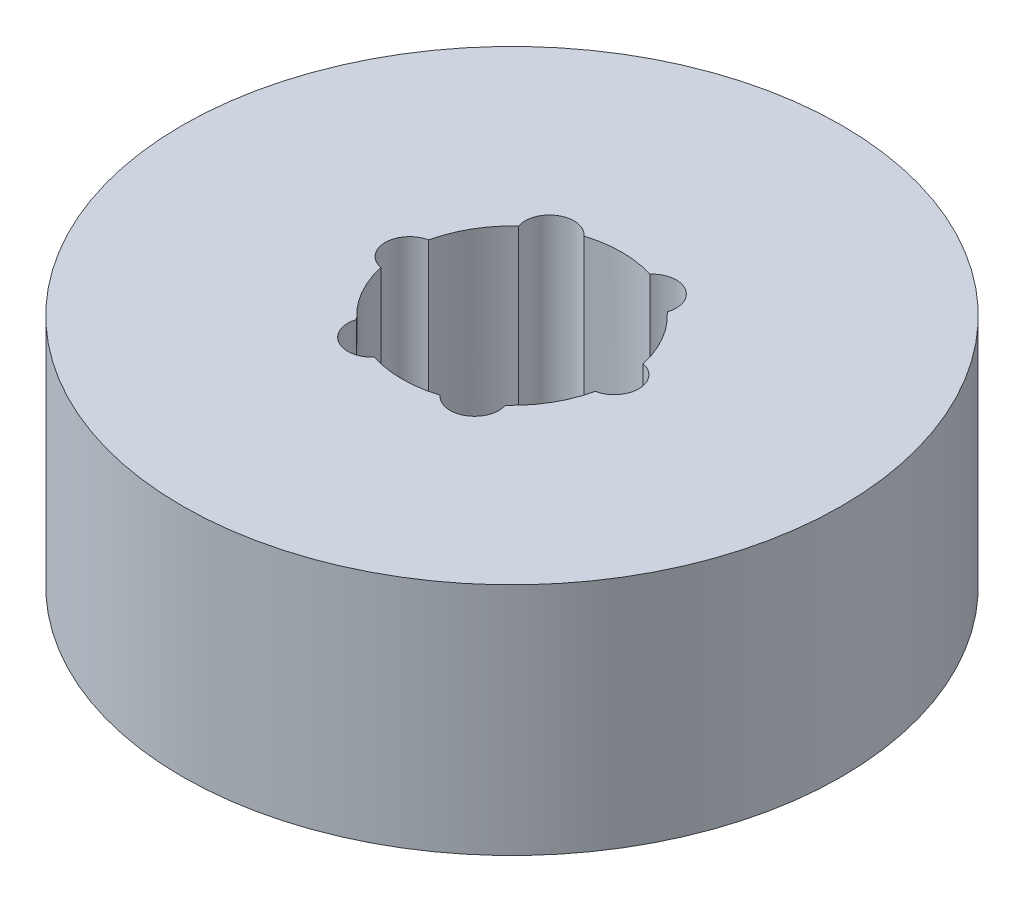
ISO-10303-21;
HEADER;
FILE_DESCRIPTION(('STEP AP214'),'2;1');
FILE_NAME('part.step','',(''),(''),'','','');
FILE_SCHEMA(('AUTOMOTIVE_DESIGN { 1 0 10303 214 1 1 1 1 }'));
ENDSEC;
DATA;
#1=APPLICATION_CONTEXT('core data for automotive mechanical design processes');
#2=APPLICATION_PROTOCOL_DEFINITION('international standard','automotive_design',2000,#1);
#3=PRODUCT_CONTEXT('',#1,'mechanical');
#4=PRODUCT('Part','Part','',(#3));
#5=PRODUCT_RELATED_PRODUCT_CATEGORY('part','',(#4));
#6=PRODUCT_DEFINITION_FORMATION('','',#4);
#7=PRODUCT_DEFINITION_CONTEXT('part definition',#1,'design');
#8=PRODUCT_DEFINITION('design','',#6,#7);
#9=PRODUCT_DEFINITION_SHAPE('','',#8);
#10=(LENGTH_UNIT() NAMED_UNIT(*) SI_UNIT(.MILLI.,.METRE.));
#11=(NAMED_UNIT(*) PLANE_ANGLE_UNIT() SI_UNIT($,.RADIAN.));
#12=(NAMED_UNIT(*) SI_UNIT($,.STERADIAN.) SOLID_ANGLE_UNIT());
#13=UNCERTAINTY_MEASURE_WITH_UNIT(LENGTH_MEASURE(1.E-05),#10,'distance_accuracy_value','');
#14=(GEOMETRIC_REPRESENTATION_CONTEXT(3) GLOBAL_UNCERTAINTY_ASSIGNED_CONTEXT((#13)) GLOBAL_UNIT_ASSIGNED_CONTEXT((#10,
#11,#12)) REPRESENTATION_CONTEXT('',''));
#15=CARTESIAN_POINT('',(0.,0.,0.));
#16=DIRECTION('',(0.,0.,1.));
#17=DIRECTION('',(1.,0.,0.));
#18=AXIS2_PLACEMENT_3D('',#15,#16,#17);
#19=CARTESIAN_POINT('',(0.,16.,0.));
#20=DIRECTION('',(0.,-1.,0.));
#21=DIRECTION('',(0.,0.,-1.));
#22=AXIS2_PLACEMENT_3D('',#19,#20,#21);
#23=CYLINDRICAL_SURFACE('',#22,22.5);
#24=CARTESIAN_POINT('',(0.,16.,0.));
#25=DIRECTION('',(0.,1.,0.));
#26=DIRECTION('',(0.,0.,1.));
#27=AXIS2_PLACEMENT_3D('',#24,#25,#26);
#28=CIRCLE('',#27,22.5);
#29=CARTESIAN_POINT('',(0.,16.,22.5));
#30=VERTEX_POINT('',#29);
#31=EDGE_CURVE('E162',#30,#30,#28,.T.);
#32=ORIENTED_EDGE('',*,*,#31,.F.);
#33=EDGE_LOOP('',(#32));
#34=FACE_BOUND('',#33,.T.);
#35=CARTESIAN_POINT('',(0.,0.,0.));
#36=DIRECTION('',(0.,1.,0.));
#37=DIRECTION('',(0.,0.,1.));
#38=AXIS2_PLACEMENT_3D('',#35,#36,#37);
#39=CIRCLE('',#38,22.5);
#40=CARTESIAN_POINT('',(0.,0.,22.5));
#41=VERTEX_POINT('',#40);
#42=EDGE_CURVE('E157',#41,#41,#39,.T.);
#43=ORIENTED_EDGE('',*,*,#42,.T.);
#44=EDGE_LOOP('',(#43));
#45=FACE_BOUND('',#44,.T.);
#46=ADVANCED_FACE('F39',(#34,#45),#23,.T.);
#47=CARTESIAN_POINT('',(0.,16.,0.));
#48=DIRECTION('',(0.,1.,0.));
#49=DIRECTION('',(0.,0.,1.));
#50=AXIS2_PLACEMENT_3D('',#47,#48,#49);
#51=PLANE('',#50);
#52=CARTESIAN_POINT('',(-3.49248716562704,16.,-6.04916521564808));
#53=DIRECTION('',(0.,1.,0.));
#54=DIRECTION('',(-0.866025403784433,0.,0.50000000000001));
#55=AXIS2_PLACEMENT_3D('',#52,#53,#54);
#56=CIRCLE('',#55,1.66763115500173);
#57=CARTESIAN_POINT('',(-2.24517787898687,16.,-7.15605871214791));
#58=VERTEX_POINT('',#57);
#59=CARTESIAN_POINT('',(-5.07473969619974,16.,-5.52241043529133));
#60=VERTEX_POINT('',#59);
#61=EDGE_CURVE('E218',#58,#60,#56,.T.);
#62=ORIENTED_EDGE('',*,*,#61,.F.);
#63=CARTESIAN_POINT('',(0.,16.,0.));
#64=DIRECTION('',(0.,1.,0.));
#65=DIRECTION('',(0.,0.,1.));
#66=AXIS2_PLACEMENT_3D('',#63,#64,#65);
#67=CIRCLE('',#66,7.5);
#68=CARTESIAN_POINT('',(2.24517787898672,16.,-7.15605871214796));
#69=VERTEX_POINT('',#68);
#70=EDGE_CURVE('E169',#69,#58,#67,.T.);
#71=ORIENTED_EDGE('',*,*,#70,.F.);
#72=CARTESIAN_POINT('',(3.49248716562691,16.,-6.04916521564816));
#73=DIRECTION('',(0.,1.,0.));
#74=DIRECTION('',(-0.866025403784443,0.,-0.499999999999992));
#75=AXIS2_PLACEMENT_3D('',#72,#73,#74);
#76=CIRCLE('',#75,1.66763115500173);
#77=CARTESIAN_POINT('',(5.07473969619962,16.,-5.52241043529144));
#78=VERTEX_POINT('',#77);
#79=EDGE_CURVE('E285',#78,#69,#76,.T.);
#80=ORIENTED_EDGE('',*,*,#79,.F.);
#81=CARTESIAN_POINT('',(7.31991757518646,16.,-1.63364827685654));
#82=VERTEX_POINT('',#81);
#83=EDGE_CURVE('E174',#82,#78,#67,.T.);
#84=ORIENTED_EDGE('',*,*,#83,.F.);
#85=CARTESIAN_POINT('',(6.98497433125393,16.,0.));
#86=DIRECTION('',(0.,1.,0.));
#87=DIRECTION('',(0.,0.,-1.));
#88=AXIS2_PLACEMENT_3D('',#85,#86,#87);
#89=CIRCLE('',#88,1.66763115500173);
#90=CARTESIAN_POINT('',(7.31991757518646,16.,1.63364827685654));
#91=VERTEX_POINT('',#90);
#92=EDGE_CURVE('E280',#91,#82,#89,.T.);
#93=ORIENTED_EDGE('',*,*,#92,.F.);
#94=CARTESIAN_POINT('',(5.0747396961997,16.,5.52241043529137));
#95=VERTEX_POINT('',#94);
#96=EDGE_CURVE('E164',#95,#91,#67,.T.);
#97=ORIENTED_EDGE('',*,*,#96,.F.);
#98=CARTESIAN_POINT('',(3.49248716562699,16.,6.04916521564811));
#99=DIRECTION('',(0.,1.,0.));
#100=DIRECTION('',(0.866025403784436,0.,-0.500000000000004));
#101=AXIS2_PLACEMENT_3D('',#98,#99,#100);
#102=CIRCLE('',#101,1.66763115500173);
#103=CARTESIAN_POINT('',(2.24517787898682,16.,7.15605871214792));
#104=VERTEX_POINT('',#103);
#105=EDGE_CURVE('E269',#104,#95,#102,.T.);
#106=ORIENTED_EDGE('',*,*,#105,.F.);
#107=CARTESIAN_POINT('',(-2.24517787898677,16.,7.15605871214794));
#108=VERTEX_POINT('',#107);
#109=EDGE_CURVE('E149',#108,#104,#67,.T.);
#110=ORIENTED_EDGE('',*,*,#109,.F.);
#111=CARTESIAN_POINT('',(-3.49248716562695,16.,6.04916521564813));
#112=DIRECTION('',(0.,1.,0.));
#113=DIRECTION('',(0.86602540378444,0.,0.499999999999998));
#114=AXIS2_PLACEMENT_3D('',#111,#112,#113);
#115=CIRCLE('',#114,1.66763115500173);
#116=CARTESIAN_POINT('',(-5.07473969619966,16.,5.52241043529141));
#117=VERTEX_POINT('',#116);
#118=EDGE_CURVE('E128',#117,#108,#115,.T.);
#119=ORIENTED_EDGE('',*,*,#118,.F.);
#120=CARTESIAN_POINT('',(-7.31991757518646,16.,1.63364827685654));
#121=VERTEX_POINT('',#120);
#122=EDGE_CURVE('E148',#121,#117,#67,.T.);
#123=ORIENTED_EDGE('',*,*,#122,.F.);
#124=CARTESIAN_POINT('',(-6.98497433125393,16.,0.));
#125=DIRECTION('',(0.,1.,0.));
#126=DIRECTION('',(0.,0.,1.));
#127=AXIS2_PLACEMENT_3D('',#124,#125,#126);
#128=CIRCLE('',#127,1.66763115500173);
#129=CARTESIAN_POINT('',(-7.31991757518646,16.,-1.63364827685654));
#130=VERTEX_POINT('',#129);
#131=EDGE_CURVE('E179',#130,#121,#128,.T.);
#132=ORIENTED_EDGE('',*,*,#131,.F.);
#133=EDGE_CURVE('E161',#60,#130,#67,.T.);
#134=ORIENTED_EDGE('',*,*,#133,.F.);
#135=EDGE_LOOP('',(#62,#71,#80,#84,#93,#97,#106,#110,#119,#123,#132,#134));
#136=FACE_BOUND('',#135,.T.);
#137=ORIENTED_EDGE('',*,*,#31,.T.);
#138=EDGE_LOOP('',(#137));
#139=FACE_BOUND('',#138,.T.);
#140=ADVANCED_FACE('F141',(#136,#139),#51,.T.);
#141=CARTESIAN_POINT('',(0.,0.,0.));
#142=DIRECTION('',(0.,1.,0.));
#143=DIRECTION('',(0.,0.,1.));
#144=AXIS2_PLACEMENT_3D('',#141,#142,#143);
#145=PLANE('',#144);
#146=CARTESIAN_POINT('',(0.,0.,0.));
#147=DIRECTION('',(0.,1.,0.));
#148=DIRECTION('',(0.,0.,1.));
#149=AXIS2_PLACEMENT_3D('',#146,#147,#148);
#150=CIRCLE('',#149,7.5);
#151=CARTESIAN_POINT('',(0.,0.,7.5));
#152=VERTEX_POINT('',#151);
#153=EDGE_CURVE('E166',#152,#152,#150,.T.);
#154=ORIENTED_EDGE('',*,*,#153,.T.);
#155=EDGE_LOOP('',(#154));
#156=FACE_BOUND('',#155,.T.);
#157=ORIENTED_EDGE('',*,*,#42,.F.);
#158=EDGE_LOOP('',(#157));
#159=FACE_BOUND('',#158,.T.);
#160=ADVANCED_FACE('F234',(#156,#159),#145,.F.);
#161=CARTESIAN_POINT('',(0.,16.,0.));
#162=DIRECTION('',(0.,-1.,0.));
#163=DIRECTION('',(0.,0.,-1.));
#164=AXIS2_PLACEMENT_3D('',#161,#162,#163);
#165=CYLINDRICAL_SURFACE('',#164,7.5);
#166=DIRECTION('',(0.,1.,0.));
#167=VECTOR('',#166,1.);
#168=CARTESIAN_POINT('',(-2.24517787898687,8.12770351334113,-7.15605871214791));
#169=LINE('',#168,#167);
#170=CARTESIAN_POINT('',(-2.24517787898687,0.255407026682267,-7.15605871214791));
#171=VERTEX_POINT('',#170);
#172=EDGE_CURVE('E11',#171,#58,#169,.T.);
#173=ORIENTED_EDGE('',*,*,#172,.F.);
#174=CARTESIAN_POINT('',(0.,0.255407026682267,0.));
#175=DIRECTION('',(0.,1.,0.));
#176=DIRECTION('',(0.,0.,1.));
#177=AXIS2_PLACEMENT_3D('',#174,#175,#176);
#178=CIRCLE('',#177,7.5);
#179=CARTESIAN_POINT('',(-5.07473969619974,0.255407026682267,-5.52241043529133));
#180=VERTEX_POINT('',#179);
#181=EDGE_CURVE('E214',#171,#180,#178,.T.);
#182=ORIENTED_EDGE('',*,*,#181,.T.);
#183=DIRECTION('',(0.,1.,0.));
#184=VECTOR('',#183,1.);
#185=CARTESIAN_POINT('',(-5.07473969619974,8.12770351334113,-5.52241043529133));
#186=LINE('',#185,#184);
#187=EDGE_CURVE('E46',#60,#180,#186,.F.);
#188=ORIENTED_EDGE('',*,*,#187,.F.);
#189=ORIENTED_EDGE('',*,*,#133,.T.);
#190=DIRECTION('',(0.,1.,0.));
#191=VECTOR('',#190,1.);
#192=CARTESIAN_POINT('',(-7.31991757518646,8.12770351334113,-1.63364827685654));
#193=LINE('',#192,#191);
#194=CARTESIAN_POINT('',(-7.31991757518646,0.255407026682267,-1.63364827685654));
#195=VERTEX_POINT('',#194);
#196=EDGE_CURVE('E187',#195,#130,#193,.T.);
#197=ORIENTED_EDGE('',*,*,#196,.F.);
#198=CARTESIAN_POINT('',(0.,0.255407026682267,0.));
#199=DIRECTION('',(0.,1.,0.));
#200=DIRECTION('',(0.,0.,1.));
#201=AXIS2_PLACEMENT_3D('',#198,#199,#200);
#202=CIRCLE('',#201,7.5);
#203=CARTESIAN_POINT('',(-7.31991757518646,0.255407026682267,1.63364827685654));
#204=VERTEX_POINT('',#203);
#205=EDGE_CURVE('E184',#195,#204,#202,.T.);
#206=ORIENTED_EDGE('',*,*,#205,.T.);
#207=DIRECTION('',(0.,1.,0.));
#208=VECTOR('',#207,1.);
#209=CARTESIAN_POINT('',(-7.31991757518646,8.12770351334113,1.63364827685654));
#210=LINE('',#209,#208);
#211=EDGE_CURVE('E158',#121,#204,#210,.F.);
#212=ORIENTED_EDGE('',*,*,#211,.F.);
#213=ORIENTED_EDGE('',*,*,#122,.T.);
#214=DIRECTION('',(0.,1.,0.));
#215=VECTOR('',#214,1.);
#216=CARTESIAN_POINT('',(-5.07473969619966,8.12770351334113,5.5224104352914));
#217=LINE('',#216,#215);
#218=CARTESIAN_POINT('',(-5.07473969619966,0.255407026682267,5.52241043529141));
#219=VERTEX_POINT('',#218);
#220=EDGE_CURVE('E127',#219,#117,#217,.T.);
#221=ORIENTED_EDGE('',*,*,#220,.F.);
#222=CARTESIAN_POINT('',(0.,0.255407026682267,0.));
#223=DIRECTION('',(0.,1.,0.));
#224=DIRECTION('',(0.,0.,1.));
#225=AXIS2_PLACEMENT_3D('',#222,#223,#224);
#226=CIRCLE('',#225,7.5);
#227=CARTESIAN_POINT('',(-2.24517787898677,0.255407026682267,7.15605871214794));
#228=VERTEX_POINT('',#227);
#229=EDGE_CURVE('E189',#219,#228,#226,.T.);
#230=ORIENTED_EDGE('',*,*,#229,.T.);
#231=DIRECTION('',(0.,1.,0.));
#232=VECTOR('',#231,1.);
#233=CARTESIAN_POINT('',(-2.24517787898677,8.12770351334113,7.15605871214794));
#234=LINE('',#233,#232);
#235=EDGE_CURVE('E140',#108,#228,#234,.F.);
#236=ORIENTED_EDGE('',*,*,#235,.F.);
#237=ORIENTED_EDGE('',*,*,#109,.T.);
#238=DIRECTION('',(0.,1.,0.));
#239=VECTOR('',#238,1.);
#240=CARTESIAN_POINT('',(2.24517787898682,8.12770351334113,7.15605871214793));
#241=LINE('',#240,#239);
#242=CARTESIAN_POINT('',(2.24517787898682,0.255407026682267,7.15605871214792));
#243=VERTEX_POINT('',#242);
#244=EDGE_CURVE('E196',#243,#104,#241,.T.);
#245=ORIENTED_EDGE('',*,*,#244,.F.);
#246=CARTESIAN_POINT('',(0.,0.255407026682267,0.));
#247=DIRECTION('',(0.,1.,0.));
#248=DIRECTION('',(0.,0.,1.));
#249=AXIS2_PLACEMENT_3D('',#246,#247,#248);
#250=CIRCLE('',#249,7.5);
#251=CARTESIAN_POINT('',(5.0747396961997,0.255407026682267,5.52241043529137));
#252=VERTEX_POINT('',#251);
#253=EDGE_CURVE('E136',#243,#252,#250,.T.);
#254=ORIENTED_EDGE('',*,*,#253,.T.);
#255=DIRECTION('',(0.,1.,0.));
#256=VECTOR('',#255,1.);
#257=CARTESIAN_POINT('',(5.0747396961997,8.12770351334113,5.52241043529137));
#258=LINE('',#257,#256);
#259=EDGE_CURVE('E194',#95,#252,#258,.F.);
#260=ORIENTED_EDGE('',*,*,#259,.F.);
#261=ORIENTED_EDGE('',*,*,#96,.T.);
#262=DIRECTION('',(0.,1.,0.));
#263=VECTOR('',#262,1.);
#264=CARTESIAN_POINT('',(7.31991757518646,8.12770351334113,1.63364827685654));
#265=LINE('',#264,#263);
#266=CARTESIAN_POINT('',(7.31991757518646,0.255407026682267,1.63364827685654));
#267=VERTEX_POINT('',#266);
#268=EDGE_CURVE('E206',#267,#91,#265,.T.);
#269=ORIENTED_EDGE('',*,*,#268,.F.);
#270=CARTESIAN_POINT('',(0.,0.255407026682267,0.));
#271=DIRECTION('',(0.,1.,0.));
#272=DIRECTION('',(0.,0.,1.));
#273=AXIS2_PLACEMENT_3D('',#270,#271,#272);
#274=CIRCLE('',#273,7.5);
#275=CARTESIAN_POINT('',(7.31991757518646,0.255407026682267,-1.63364827685654));
#276=VERTEX_POINT('',#275);
#277=EDGE_CURVE('E199',#267,#276,#274,.T.);
#278=ORIENTED_EDGE('',*,*,#277,.T.);
#279=DIRECTION('',(0.,1.,0.));
#280=VECTOR('',#279,1.);
#281=CARTESIAN_POINT('',(7.31991757518646,8.12770351334113,-1.63364827685654));
#282=LINE('',#281,#280);
#283=EDGE_CURVE('E201',#82,#276,#282,.F.);
#284=ORIENTED_EDGE('',*,*,#283,.F.);
#285=ORIENTED_EDGE('',*,*,#83,.T.);
#286=DIRECTION('',(0.,1.,0.));
#287=VECTOR('',#286,1.);
#288=CARTESIAN_POINT('',(5.07473969619962,8.12770351334113,-5.52241043529144));
#289=LINE('',#288,#287);
#290=CARTESIAN_POINT('',(5.07473969619962,0.255407026682267,-5.52241043529144));
#291=VERTEX_POINT('',#290);
#292=EDGE_CURVE('E213',#291,#78,#289,.T.);
#293=ORIENTED_EDGE('',*,*,#292,.F.);
#294=CARTESIAN_POINT('',(0.,0.255407026682267,0.));
#295=DIRECTION('',(0.,1.,0.));
#296=DIRECTION('',(0.,0.,1.));
#297=AXIS2_PLACEMENT_3D('',#294,#295,#296);
#298=CIRCLE('',#297,7.5);
#299=CARTESIAN_POINT('',(2.24517787898672,0.255407026682267,-7.15605871214796));
#300=VERTEX_POINT('',#299);
#301=EDGE_CURVE('E208',#291,#300,#298,.T.);
#302=ORIENTED_EDGE('',*,*,#301,.T.);
#303=DIRECTION('',(0.,1.,0.));
#304=VECTOR('',#303,1.);
#305=CARTESIAN_POINT('',(2.24517787898672,8.12770351334113,-7.15605871214796));
#306=LINE('',#305,#304);
#307=EDGE_CURVE('E211',#69,#300,#306,.F.);
#308=ORIENTED_EDGE('',*,*,#307,.F.);
#309=ORIENTED_EDGE('',*,*,#70,.T.);
#310=EDGE_LOOP('',(#173,#182,#188,#189,#197,#206,#212,#213,#221,#230,#236,#237,#245,#254,#260,
#261,#269,#278,#284,#285,#293,#302,#308,#309));
#311=FACE_BOUND('',#310,.T.);
#312=ORIENTED_EDGE('',*,*,#153,.F.);
#313=EDGE_LOOP('',(#312));
#314=FACE_BOUND('',#313,.T.);
#315=ADVANCED_FACE('F152',(#311,#314),#165,.F.);
#316=CARTESIAN_POINT('',(-6.98497433125393,0.255407026682267,0.));
#317=DIRECTION('',(0.,1.,0.));
#318=DIRECTION('',(0.,0.,1.));
#319=AXIS2_PLACEMENT_3D('',#316,#317,#318);
#320=CYLINDRICAL_SURFACE('',#319,1.66763115500173);
#321=ORIENTED_EDGE('',*,*,#196,.T.);
#322=ORIENTED_EDGE('',*,*,#131,.T.);
#323=ORIENTED_EDGE('',*,*,#211,.T.);
#324=CARTESIAN_POINT('',(-6.98497433125393,0.255407026682267,0.));
#325=DIRECTION('',(0.,1.,0.));
#326=DIRECTION('',(0.,0.,1.));
#327=AXIS2_PLACEMENT_3D('',#324,#325,#326);
#328=CIRCLE('',#327,1.66763115500173);
#329=EDGE_CURVE('E180',#195,#204,#328,.T.);
#330=ORIENTED_EDGE('',*,*,#329,.F.);
#331=EDGE_LOOP('',(#321,#322,#323,#330));
#332=FACE_BOUND('',#331,.T.);
#333=ADVANCED_FACE('F244',(#332),#320,.F.);
#334=CARTESIAN_POINT('',(-6.98497433125393,0.255407026682267,0.));
#335=DIRECTION('',(0.,1.,0.));
#336=DIRECTION('',(0.,0.,1.));
#337=AXIS2_PLACEMENT_3D('',#334,#335,#336);
#338=PLANE('',#337);
#339=ORIENTED_EDGE('',*,*,#329,.T.);
#340=ORIENTED_EDGE('',*,*,#205,.F.);
#341=EDGE_LOOP('',(#339,#340));
#342=FACE_BOUND('',#341,.T.);
#343=ADVANCED_FACE('F248',(#342),#338,.T.);
#344=CARTESIAN_POINT('',(-3.49248716562695,0.255407026682267,6.04916521564813));
#345=DIRECTION('',(0.,1.,0.));
#346=DIRECTION('',(0.,0.,1.));
#347=AXIS2_PLACEMENT_3D('',#344,#345,#346);
#348=CYLINDRICAL_SURFACE('',#347,1.66763115500173);
#349=ORIENTED_EDGE('',*,*,#220,.T.);
#350=ORIENTED_EDGE('',*,*,#118,.T.);
#351=ORIENTED_EDGE('',*,*,#235,.T.);
#352=CARTESIAN_POINT('',(-3.49248716562695,0.255407026682267,6.04916521564813));
#353=DIRECTION('',(0.,1.,0.));
#354=DIRECTION('',(0.86602540378444,0.,0.499999999999998));
#355=AXIS2_PLACEMENT_3D('',#352,#353,#354);
#356=CIRCLE('',#355,1.66763115500173);
#357=EDGE_CURVE('E135',#219,#228,#356,.T.);
#358=ORIENTED_EDGE('',*,*,#357,.F.);
#359=EDGE_LOOP('',(#349,#350,#351,#358));
#360=FACE_BOUND('',#359,.T.);
#361=ADVANCED_FACE('F126',(#360),#348,.F.);
#362=CARTESIAN_POINT('',(-3.49248716562695,0.255407026682267,6.04916521564813));
#363=DIRECTION('',(0.,1.,0.));
#364=DIRECTION('',(0.86602540378444,0.,0.499999999999998));
#365=AXIS2_PLACEMENT_3D('',#362,#363,#364);
#366=PLANE('',#365);
#367=ORIENTED_EDGE('',*,*,#357,.T.);
#368=ORIENTED_EDGE('',*,*,#229,.F.);
#369=EDGE_LOOP('',(#367,#368));
#370=FACE_BOUND('',#369,.T.);
#371=ADVANCED_FACE('F258',(#370),#366,.T.);
#372=CARTESIAN_POINT('',(3.49248716562699,0.255407026682267,6.04916521564811));
#373=DIRECTION('',(0.,1.,0.));
#374=DIRECTION('',(0.,0.,1.));
#375=AXIS2_PLACEMENT_3D('',#372,#373,#374);
#376=CYLINDRICAL_SURFACE('',#375,1.66763115500173);
#377=ORIENTED_EDGE('',*,*,#244,.T.);
#378=ORIENTED_EDGE('',*,*,#105,.T.);
#379=ORIENTED_EDGE('',*,*,#259,.T.);
#380=CARTESIAN_POINT('',(3.49248716562699,0.255407026682267,6.04916521564811));
#381=DIRECTION('',(0.,1.,0.));
#382=DIRECTION('',(0.866025403784436,0.,-0.500000000000004));
#383=AXIS2_PLACEMENT_3D('',#380,#381,#382);
#384=CIRCLE('',#383,1.66763115500173);
#385=EDGE_CURVE('E147',#243,#252,#384,.T.);
#386=ORIENTED_EDGE('',*,*,#385,.F.);
#387=EDGE_LOOP('',(#377,#378,#379,#386));
#388=FACE_BOUND('',#387,.T.);
#389=ADVANCED_FACE('F256',(#388),#376,.F.);
#390=CARTESIAN_POINT('',(3.49248716562699,0.255407026682267,6.04916521564811));
#391=DIRECTION('',(0.,1.,0.));
#392=DIRECTION('',(0.866025403784436,0.,-0.500000000000004));
#393=AXIS2_PLACEMENT_3D('',#390,#391,#392);
#394=PLANE('',#393);
#395=ORIENTED_EDGE('',*,*,#385,.T.);
#396=ORIENTED_EDGE('',*,*,#253,.F.);
#397=EDGE_LOOP('',(#395,#396));
#398=FACE_BOUND('',#397,.T.);
#399=ADVANCED_FACE('F263',(#398),#394,.T.);
#400=CARTESIAN_POINT('',(6.98497433125393,0.255407026682267,0.));
#401=DIRECTION('',(0.,1.,0.));
#402=DIRECTION('',(0.,0.,1.));
#403=AXIS2_PLACEMENT_3D('',#400,#401,#402);
#404=CYLINDRICAL_SURFACE('',#403,1.66763115500173);
#405=ORIENTED_EDGE('',*,*,#268,.T.);
#406=ORIENTED_EDGE('',*,*,#92,.T.);
#407=ORIENTED_EDGE('',*,*,#283,.T.);
#408=CARTESIAN_POINT('',(6.98497433125393,0.255407026682267,0.));
#409=DIRECTION('',(0.,1.,0.));
#410=DIRECTION('',(0.,0.,-1.));
#411=AXIS2_PLACEMENT_3D('',#408,#409,#410);
#412=CIRCLE('',#411,1.66763115500173);
#413=EDGE_CURVE('E273',#267,#276,#412,.T.);
#414=ORIENTED_EDGE('',*,*,#413,.F.);
#415=EDGE_LOOP('',(#405,#406,#407,#414));
#416=FACE_BOUND('',#415,.T.);
#417=ADVANCED_FACE('F297',(#416),#404,.F.);
#418=CARTESIAN_POINT('',(6.98497433125393,0.255407026682267,0.));
#419=DIRECTION('',(0.,1.,0.));
#420=DIRECTION('',(0.,0.,-1.));
#421=AXIS2_PLACEMENT_3D('',#418,#419,#420);
#422=PLANE('',#421);
#423=ORIENTED_EDGE('',*,*,#413,.T.);
#424=ORIENTED_EDGE('',*,*,#277,.F.);
#425=EDGE_LOOP('',(#423,#424));
#426=FACE_BOUND('',#425,.T.);
#427=ADVANCED_FACE('F299',(#426),#422,.T.);
#428=CARTESIAN_POINT('',(3.49248716562691,0.255407026682267,-6.04916521564816));
#429=DIRECTION('',(0.,1.,0.));
#430=DIRECTION('',(0.,0.,1.));
#431=AXIS2_PLACEMENT_3D('',#428,#429,#430);
#432=CYLINDRICAL_SURFACE('',#431,1.66763115500173);
#433=ORIENTED_EDGE('',*,*,#292,.T.);
#434=ORIENTED_EDGE('',*,*,#79,.T.);
#435=ORIENTED_EDGE('',*,*,#307,.T.);
#436=CARTESIAN_POINT('',(3.49248716562691,0.255407026682267,-6.04916521564816));
#437=DIRECTION('',(0.,1.,0.));
#438=DIRECTION('',(-0.866025403784443,0.,-0.499999999999992));
#439=AXIS2_PLACEMENT_3D('',#436,#437,#438);
#440=CIRCLE('',#439,1.66763115500173);
#441=EDGE_CURVE('E56',#291,#300,#440,.T.);
#442=ORIENTED_EDGE('',*,*,#441,.F.);
#443=EDGE_LOOP('',(#433,#434,#435,#442));
#444=FACE_BOUND('',#443,.T.);
#445=ADVANCED_FACE('F292',(#444),#432,.F.);
#446=CARTESIAN_POINT('',(3.49248716562691,0.255407026682267,-6.04916521564816));
#447=DIRECTION('',(0.,1.,0.));
#448=DIRECTION('',(-0.866025403784443,0.,-0.499999999999992));
#449=AXIS2_PLACEMENT_3D('',#446,#447,#448);
#450=PLANE('',#449);
#451=ORIENTED_EDGE('',*,*,#441,.T.);
#452=ORIENTED_EDGE('',*,*,#301,.F.);
#453=EDGE_LOOP('',(#451,#452));
#454=FACE_BOUND('',#453,.T.);
#455=ADVANCED_FACE('F226',(#454),#450,.T.);
#456=CARTESIAN_POINT('',(-3.49248716562704,0.255407026682267,-6.04916521564808));
#457=DIRECTION('',(0.,1.,0.));
#458=DIRECTION('',(0.,0.,1.));
#459=AXIS2_PLACEMENT_3D('',#456,#457,#458);
#460=CYLINDRICAL_SURFACE('',#459,1.66763115500173);
#461=ORIENTED_EDGE('',*,*,#172,.T.);
#462=ORIENTED_EDGE('',*,*,#61,.T.);
#463=ORIENTED_EDGE('',*,*,#187,.T.);
#464=CARTESIAN_POINT('',(-3.49248716562704,0.255407026682267,-6.04916521564808));
#465=DIRECTION('',(0.,1.,0.));
#466=DIRECTION('',(-0.866025403784433,0.,0.50000000000001));
#467=AXIS2_PLACEMENT_3D('',#464,#465,#466);
#468=CIRCLE('',#467,1.66763115500173);
#469=EDGE_CURVE('E55',#171,#180,#468,.T.);
#470=ORIENTED_EDGE('',*,*,#469,.F.);
#471=EDGE_LOOP('',(#461,#462,#463,#470));
#472=FACE_BOUND('',#471,.T.);
#473=ADVANCED_FACE('F217',(#472),#460,.F.);
#474=CARTESIAN_POINT('',(-3.49248716562704,0.255407026682267,-6.04916521564808));
#475=DIRECTION('',(0.,1.,0.));
#476=DIRECTION('',(-0.866025403784433,0.,0.50000000000001));
#477=AXIS2_PLACEMENT_3D('',#474,#475,#476);
#478=PLANE('',#477);
#479=ORIENTED_EDGE('',*,*,#469,.T.);
#480=ORIENTED_EDGE('',*,*,#181,.F.);
#481=EDGE_LOOP('',(#479,#480));
#482=FACE_BOUND('',#481,.T.);
#483=ADVANCED_FACE('F219',(#482),#478,.T.);
#484=CLOSED_SHELL('',(#46,#140,#160,#315,#333,#343,#361,#371,#389,#399,#417,#427,#445,#455,#473,#483));
#485=MANIFOLD_SOLID_BREP('B2',#484);
#486=ADVANCED_BREP_SHAPE_REPRESENTATION('',(#18,#485),#14);
#487=SHAPE_DEFINITION_REPRESENTATION(#9,#486);
ENDSEC;
END-ISO-10303-21;
